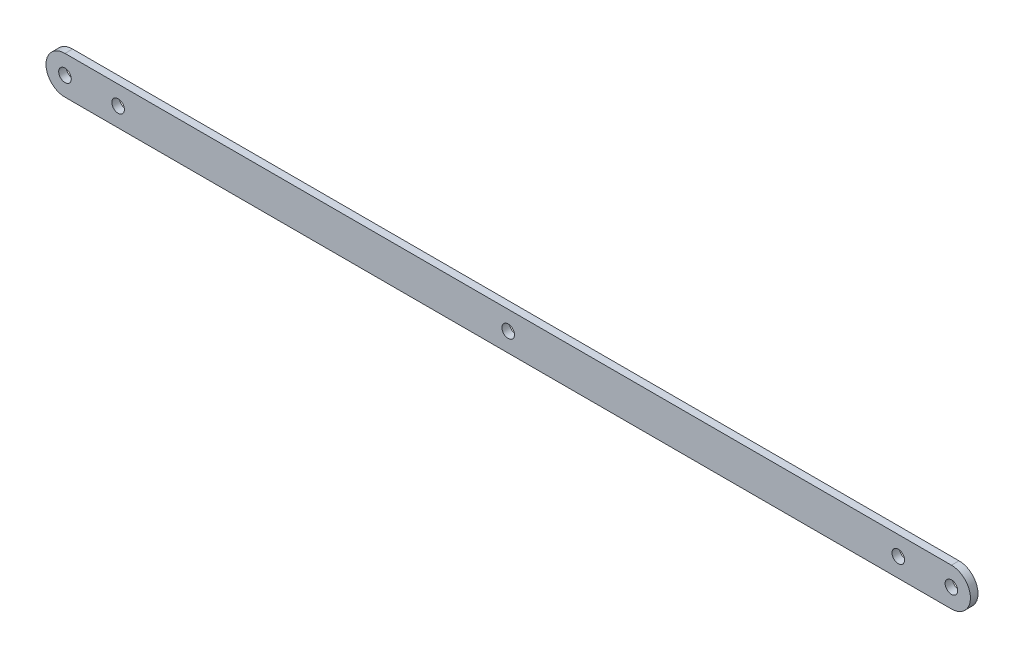
ISO-10303-21;
HEADER;
FILE_DESCRIPTION(('STEP AP214'),'2;1');
FILE_NAME('part.step','',(''),(''),'','','');
FILE_SCHEMA(('AUTOMOTIVE_DESIGN { 1 0 10303 214 1 1 1 1 }'));
ENDSEC;
DATA;
#1=APPLICATION_CONTEXT('core data for automotive mechanical design processes');
#2=APPLICATION_PROTOCOL_DEFINITION('international standard','automotive_design',2000,#1);
#3=PRODUCT_CONTEXT('',#1,'mechanical');
#4=PRODUCT('Part','Part','',(#3));
#5=PRODUCT_RELATED_PRODUCT_CATEGORY('part','',(#4));
#6=PRODUCT_DEFINITION_FORMATION('','',#4);
#7=PRODUCT_DEFINITION_CONTEXT('part definition',#1,'design');
#8=PRODUCT_DEFINITION('design','',#6,#7);
#9=PRODUCT_DEFINITION_SHAPE('','',#8);
#10=(LENGTH_UNIT() NAMED_UNIT(*) SI_UNIT(.MILLI.,.METRE.));
#11=(NAMED_UNIT(*) PLANE_ANGLE_UNIT() SI_UNIT($,.RADIAN.));
#12=(NAMED_UNIT(*) SI_UNIT($,.STERADIAN.) SOLID_ANGLE_UNIT());
#13=UNCERTAINTY_MEASURE_WITH_UNIT(LENGTH_MEASURE(1.E-05),#10,'distance_accuracy_value','');
#14=(GEOMETRIC_REPRESENTATION_CONTEXT(3) GLOBAL_UNCERTAINTY_ASSIGNED_CONTEXT((#13)) GLOBAL_UNIT_ASSIGNED_CONTEXT((#10,
#11,#12)) REPRESENTATION_CONTEXT('',''));
#15=CARTESIAN_POINT('',(0.,0.,0.));
#16=DIRECTION('',(0.,0.,1.));
#17=DIRECTION('',(1.,0.,0.));
#18=AXIS2_PLACEMENT_3D('',#15,#16,#17);
#19=CARTESIAN_POINT('',(0.,0.,5.));
#20=DIRECTION('',(0.,0.,1.));
#21=DIRECTION('',(1.,0.,0.));
#22=AXIS2_PLACEMENT_3D('',#19,#20,#21);
#23=PLANE('',#22);
#24=CARTESIAN_POINT('',(292.,0.,5.));
#25=DIRECTION('',(0.,0.,1.));
#26=DIRECTION('',(1.,0.,0.));
#27=AXIS2_PLACEMENT_3D('',#24,#25,#26);
#28=CIRCLE('',#27,4.15000000000001);
#29=CARTESIAN_POINT('',(296.15,0.,5.));
#30=VERTEX_POINT('',#29);
#31=EDGE_CURVE('E127',#30,#30,#28,.T.);
#32=ORIENTED_EDGE('',*,*,#31,.F.);
#33=EDGE_LOOP('',(#32));
#34=FACE_BOUND('',#33,.T.);
#35=CARTESIAN_POINT('',(584.,0.,5.));
#36=DIRECTION('',(0.,0.,1.));
#37=DIRECTION('',(1.,0.,0.));
#38=AXIS2_PLACEMENT_3D('',#35,#36,#37);
#39=CIRCLE('',#38,4.14999999999996);
#40=CARTESIAN_POINT('',(588.15,0.,5.));
#41=VERTEX_POINT('',#40);
#42=EDGE_CURVE('E115',#41,#41,#39,.T.);
#43=ORIENTED_EDGE('',*,*,#42,.F.);
#44=EDGE_LOOP('',(#43));
#45=FACE_BOUND('',#44,.T.);
#46=CARTESIAN_POINT('',(0.,0.,5.));
#47=DIRECTION('',(0.,0.,1.));
#48=DIRECTION('',(1.,0.,0.));
#49=AXIS2_PLACEMENT_3D('',#46,#47,#48);
#50=CIRCLE('',#49,12.5);
#51=CARTESIAN_POINT('',(0.,12.5,5.));
#52=VERTEX_POINT('',#51);
#53=CARTESIAN_POINT('',(0.,-12.5,5.));
#54=VERTEX_POINT('',#53);
#55=EDGE_CURVE('E85',#52,#54,#50,.T.);
#56=ORIENTED_EDGE('',*,*,#55,.T.);
#57=DIRECTION('',(1.,0.,0.));
#58=VECTOR('',#57,1.);
#59=CARTESIAN_POINT('',(0.,-12.5,5.));
#60=LINE('',#59,#58);
#61=CARTESIAN_POINT('',(584.,-12.5,5.));
#62=VERTEX_POINT('',#61);
#63=EDGE_CURVE('E80',#54,#62,#60,.T.);
#64=ORIENTED_EDGE('',*,*,#63,.T.);
#65=CARTESIAN_POINT('',(584.,0.,5.));
#66=DIRECTION('',(0.,0.,1.));
#67=DIRECTION('',(-1.,0.,0.));
#68=AXIS2_PLACEMENT_3D('',#65,#66,#67);
#69=CIRCLE('',#68,12.5);
#70=CARTESIAN_POINT('',(584.,12.5,5.));
#71=VERTEX_POINT('',#70);
#72=EDGE_CURVE('E83',#62,#71,#69,.T.);
#73=ORIENTED_EDGE('',*,*,#72,.T.);
#74=DIRECTION('',(-1.,0.,0.));
#75=VECTOR('',#74,1.);
#76=CARTESIAN_POINT('',(0.,12.5,5.));
#77=LINE('',#76,#75);
#78=EDGE_CURVE('E50',#71,#52,#77,.T.);
#79=ORIENTED_EDGE('',*,*,#78,.T.);
#80=EDGE_LOOP('',(#56,#64,#73,#79));
#81=FACE_BOUND('',#80,.T.);
#82=CARTESIAN_POINT('',(0.,0.,5.));
#83=DIRECTION('',(0.,0.,1.));
#84=DIRECTION('',(1.,0.,0.));
#85=AXIS2_PLACEMENT_3D('',#82,#83,#84);
#86=CIRCLE('',#85,4.15);
#87=CARTESIAN_POINT('',(4.15,0.,5.));
#88=VERTEX_POINT('',#87);
#89=EDGE_CURVE('E100',#88,#88,#86,.T.);
#90=ORIENTED_EDGE('',*,*,#89,.F.);
#91=EDGE_LOOP('',(#90));
#92=FACE_BOUND('',#91,.T.);
#93=CARTESIAN_POINT('',(35.,0.,5.));
#94=DIRECTION('',(0.,0.,1.));
#95=DIRECTION('',(1.,0.,0.));
#96=AXIS2_PLACEMENT_3D('',#93,#94,#95);
#97=CIRCLE('',#96,4.15);
#98=CARTESIAN_POINT('',(39.15,0.,5.));
#99=VERTEX_POINT('',#98);
#100=EDGE_CURVE('E121',#99,#99,#97,.T.);
#101=ORIENTED_EDGE('',*,*,#100,.F.);
#102=EDGE_LOOP('',(#101));
#103=FACE_BOUND('',#102,.T.);
#104=CARTESIAN_POINT('',(549.,0.,5.));
#105=DIRECTION('',(0.,0.,1.));
#106=DIRECTION('',(1.,0.,0.));
#107=AXIS2_PLACEMENT_3D('',#104,#105,#106);
#108=CIRCLE('',#107,4.14999999999996);
#109=CARTESIAN_POINT('',(553.15,0.,5.));
#110=VERTEX_POINT('',#109);
#111=EDGE_CURVE('E133',#110,#110,#108,.T.);
#112=ORIENTED_EDGE('',*,*,#111,.F.);
#113=EDGE_LOOP('',(#112));
#114=FACE_BOUND('',#113,.T.);
#115=ADVANCED_FACE('F33',(#34,#45,#81,#92,#103,#114),#23,.T.);
#116=CARTESIAN_POINT('',(0.,0.,0.));
#117=DIRECTION('',(0.,0.,1.));
#118=DIRECTION('',(1.,0.,0.));
#119=AXIS2_PLACEMENT_3D('',#116,#117,#118);
#120=PLANE('',#119);
#121=CARTESIAN_POINT('',(292.,0.,0.));
#122=DIRECTION('',(0.,0.,1.));
#123=DIRECTION('',(1.,0.,0.));
#124=AXIS2_PLACEMENT_3D('',#121,#122,#123);
#125=CIRCLE('',#124,4.15000000000001);
#126=CARTESIAN_POINT('',(296.15,0.,0.));
#127=VERTEX_POINT('',#126);
#128=EDGE_CURVE('E130',#127,#127,#125,.T.);
#129=ORIENTED_EDGE('',*,*,#128,.T.);
#130=EDGE_LOOP('',(#129));
#131=FACE_BOUND('',#130,.T.);
#132=CARTESIAN_POINT('',(584.,0.,0.));
#133=DIRECTION('',(0.,0.,1.));
#134=DIRECTION('',(1.,0.,0.));
#135=AXIS2_PLACEMENT_3D('',#132,#133,#134);
#136=CIRCLE('',#135,4.14999999999996);
#137=CARTESIAN_POINT('',(588.15,0.,0.));
#138=VERTEX_POINT('',#137);
#139=EDGE_CURVE('E118',#138,#138,#136,.T.);
#140=ORIENTED_EDGE('',*,*,#139,.T.);
#141=EDGE_LOOP('',(#140));
#142=FACE_BOUND('',#141,.T.);
#143=CARTESIAN_POINT('',(0.,0.,0.));
#144=DIRECTION('',(0.,0.,1.));
#145=DIRECTION('',(1.,0.,0.));
#146=AXIS2_PLACEMENT_3D('',#143,#144,#145);
#147=CIRCLE('',#146,12.5);
#148=CARTESIAN_POINT('',(0.,12.5,0.));
#149=VERTEX_POINT('',#148);
#150=CARTESIAN_POINT('',(0.,-12.5,0.));
#151=VERTEX_POINT('',#150);
#152=EDGE_CURVE('E97',#149,#151,#147,.T.);
#153=ORIENTED_EDGE('',*,*,#152,.F.);
#154=DIRECTION('',(-1.,0.,0.));
#155=VECTOR('',#154,1.);
#156=CARTESIAN_POINT('',(0.,12.5,0.));
#157=LINE('',#156,#155);
#158=CARTESIAN_POINT('',(584.,12.5,0.));
#159=VERTEX_POINT('',#158);
#160=EDGE_CURVE('E73',#159,#149,#157,.T.);
#161=ORIENTED_EDGE('',*,*,#160,.F.);
#162=CARTESIAN_POINT('',(584.,0.,0.));
#163=DIRECTION('',(0.,0.,1.));
#164=DIRECTION('',(-1.,0.,0.));
#165=AXIS2_PLACEMENT_3D('',#162,#163,#164);
#166=CIRCLE('',#165,12.5);
#167=CARTESIAN_POINT('',(584.,-12.5,0.));
#168=VERTEX_POINT('',#167);
#169=EDGE_CURVE('E67',#168,#159,#166,.T.);
#170=ORIENTED_EDGE('',*,*,#169,.F.);
#171=DIRECTION('',(1.,0.,0.));
#172=VECTOR('',#171,1.);
#173=CARTESIAN_POINT('',(0.,-12.5,0.));
#174=LINE('',#173,#172);
#175=EDGE_CURVE('E89',#151,#168,#174,.T.);
#176=ORIENTED_EDGE('',*,*,#175,.F.);
#177=EDGE_LOOP('',(#153,#161,#170,#176));
#178=FACE_BOUND('',#177,.T.);
#179=CARTESIAN_POINT('',(0.,0.,0.));
#180=DIRECTION('',(0.,0.,1.));
#181=DIRECTION('',(1.,0.,0.));
#182=AXIS2_PLACEMENT_3D('',#179,#180,#181);
#183=CIRCLE('',#182,4.15);
#184=CARTESIAN_POINT('',(4.15,0.,0.));
#185=VERTEX_POINT('',#184);
#186=EDGE_CURVE('E112',#185,#185,#183,.T.);
#187=ORIENTED_EDGE('',*,*,#186,.T.);
#188=EDGE_LOOP('',(#187));
#189=FACE_BOUND('',#188,.T.);
#190=CARTESIAN_POINT('',(35.,0.,0.));
#191=DIRECTION('',(0.,0.,1.));
#192=DIRECTION('',(1.,0.,0.));
#193=AXIS2_PLACEMENT_3D('',#190,#191,#192);
#194=CIRCLE('',#193,4.15);
#195=CARTESIAN_POINT('',(39.15,0.,0.));
#196=VERTEX_POINT('',#195);
#197=EDGE_CURVE('E124',#196,#196,#194,.T.);
#198=ORIENTED_EDGE('',*,*,#197,.T.);
#199=EDGE_LOOP('',(#198));
#200=FACE_BOUND('',#199,.T.);
#201=CARTESIAN_POINT('',(549.,0.,0.));
#202=DIRECTION('',(0.,0.,1.));
#203=DIRECTION('',(1.,0.,0.));
#204=AXIS2_PLACEMENT_3D('',#201,#202,#203);
#205=CIRCLE('',#204,4.14999999999996);
#206=CARTESIAN_POINT('',(553.15,0.,0.));
#207=VERTEX_POINT('',#206);
#208=EDGE_CURVE('E136',#207,#207,#205,.T.);
#209=ORIENTED_EDGE('',*,*,#208,.T.);
#210=EDGE_LOOP('',(#209));
#211=FACE_BOUND('',#210,.T.);
#212=ADVANCED_FACE('F108',(#131,#142,#178,#189,#200,#211),#120,.F.);
#213=CARTESIAN_POINT('',(0.,0.,5.));
#214=DIRECTION('',(0.,0.,-1.));
#215=DIRECTION('',(-1.,0.,0.));
#216=AXIS2_PLACEMENT_3D('',#213,#214,#215);
#217=CYLINDRICAL_SURFACE('',#216,12.5);
#218=ORIENTED_EDGE('',*,*,#152,.T.);
#219=DIRECTION('',(0.,0.,-1.));
#220=VECTOR('',#219,1.);
#221=CARTESIAN_POINT('',(0.,-12.5,5.));
#222=LINE('',#221,#220);
#223=EDGE_CURVE('E11',#54,#151,#222,.T.);
#224=ORIENTED_EDGE('',*,*,#223,.F.);
#225=ORIENTED_EDGE('',*,*,#55,.F.);
#226=DIRECTION('',(0.,0.,-1.));
#227=VECTOR('',#226,1.);
#228=CARTESIAN_POINT('',(0.,12.5,5.));
#229=LINE('',#228,#227);
#230=EDGE_CURVE('E93',#52,#149,#229,.T.);
#231=ORIENTED_EDGE('',*,*,#230,.T.);
#232=EDGE_LOOP('',(#218,#224,#225,#231));
#233=FACE_BOUND('',#232,.T.);
#234=ADVANCED_FACE('F35',(#233),#217,.T.);
#235=CARTESIAN_POINT('',(0.,-12.5,5.));
#236=DIRECTION('',(0.,1.,0.));
#237=DIRECTION('',(0.,0.,1.));
#238=AXIS2_PLACEMENT_3D('',#235,#236,#237);
#239=PLANE('',#238);
#240=ORIENTED_EDGE('',*,*,#175,.T.);
#241=DIRECTION('',(0.,0.,-1.));
#242=VECTOR('',#241,1.);
#243=CARTESIAN_POINT('',(584.,-12.5,5.));
#244=LINE('',#243,#242);
#245=EDGE_CURVE('E42',#62,#168,#244,.T.);
#246=ORIENTED_EDGE('',*,*,#245,.F.);
#247=ORIENTED_EDGE('',*,*,#63,.F.);
#248=ORIENTED_EDGE('',*,*,#223,.T.);
#249=EDGE_LOOP('',(#240,#246,#247,#248));
#250=FACE_BOUND('',#249,.T.);
#251=ADVANCED_FACE('F88',(#250),#239,.F.);
#252=CARTESIAN_POINT('',(584.,0.,5.));
#253=DIRECTION('',(0.,0.,-1.));
#254=DIRECTION('',(-1.,0.,0.));
#255=AXIS2_PLACEMENT_3D('',#252,#253,#254);
#256=CYLINDRICAL_SURFACE('',#255,12.5);
#257=ORIENTED_EDGE('',*,*,#169,.T.);
#258=DIRECTION('',(0.,0.,-1.));
#259=VECTOR('',#258,1.);
#260=CARTESIAN_POINT('',(584.,12.5,5.));
#261=LINE('',#260,#259);
#262=EDGE_CURVE('E90',#71,#159,#261,.T.);
#263=ORIENTED_EDGE('',*,*,#262,.F.);
#264=ORIENTED_EDGE('',*,*,#72,.F.);
#265=ORIENTED_EDGE('',*,*,#245,.T.);
#266=EDGE_LOOP('',(#257,#263,#264,#265));
#267=FACE_BOUND('',#266,.T.);
#268=ADVANCED_FACE('F91',(#267),#256,.T.);
#269=CARTESIAN_POINT('',(0.,12.5,5.));
#270=DIRECTION('',(0.,-1.,0.));
#271=DIRECTION('',(0.,0.,-1.));
#272=AXIS2_PLACEMENT_3D('',#269,#270,#271);
#273=PLANE('',#272);
#274=ORIENTED_EDGE('',*,*,#160,.T.);
#275=ORIENTED_EDGE('',*,*,#230,.F.);
#276=ORIENTED_EDGE('',*,*,#78,.F.);
#277=ORIENTED_EDGE('',*,*,#262,.T.);
#278=EDGE_LOOP('',(#274,#275,#276,#277));
#279=FACE_BOUND('',#278,.T.);
#280=ADVANCED_FACE('F105',(#279),#273,.F.);
#281=CARTESIAN_POINT('',(0.,0.,5.));
#282=DIRECTION('',(0.,0.,-1.));
#283=DIRECTION('',(-1.,0.,0.));
#284=AXIS2_PLACEMENT_3D('',#281,#282,#283);
#285=CYLINDRICAL_SURFACE('',#284,4.15);
#286=ORIENTED_EDGE('',*,*,#89,.T.);
#287=EDGE_LOOP('',(#286));
#288=FACE_BOUND('',#287,.T.);
#289=ORIENTED_EDGE('',*,*,#186,.F.);
#290=EDGE_LOOP('',(#289));
#291=FACE_BOUND('',#290,.T.);
#292=ADVANCED_FACE('F156',(#288,#291),#285,.F.);
#293=CARTESIAN_POINT('',(584.,0.,5.));
#294=DIRECTION('',(0.,0.,-1.));
#295=DIRECTION('',(-1.,0.,0.));
#296=AXIS2_PLACEMENT_3D('',#293,#294,#295);
#297=CYLINDRICAL_SURFACE('',#296,4.14999999999996);
#298=ORIENTED_EDGE('',*,*,#42,.T.);
#299=EDGE_LOOP('',(#298));
#300=FACE_BOUND('',#299,.T.);
#301=ORIENTED_EDGE('',*,*,#139,.F.);
#302=EDGE_LOOP('',(#301));
#303=FACE_BOUND('',#302,.T.);
#304=ADVANCED_FACE('F202',(#300,#303),#297,.F.);
#305=CARTESIAN_POINT('',(35.,0.,5.));
#306=DIRECTION('',(0.,0.,-1.));
#307=DIRECTION('',(-1.,0.,0.));
#308=AXIS2_PLACEMENT_3D('',#305,#306,#307);
#309=CYLINDRICAL_SURFACE('',#308,4.15);
#310=ORIENTED_EDGE('',*,*,#100,.T.);
#311=EDGE_LOOP('',(#310));
#312=FACE_BOUND('',#311,.T.);
#313=ORIENTED_EDGE('',*,*,#197,.F.);
#314=EDGE_LOOP('',(#313));
#315=FACE_BOUND('',#314,.T.);
#316=ADVANCED_FACE('F210',(#312,#315),#309,.F.);
#317=CARTESIAN_POINT('',(292.,0.,5.));
#318=DIRECTION('',(0.,0.,-1.));
#319=DIRECTION('',(-1.,0.,0.));
#320=AXIS2_PLACEMENT_3D('',#317,#318,#319);
#321=CYLINDRICAL_SURFACE('',#320,4.15000000000001);
#322=ORIENTED_EDGE('',*,*,#31,.T.);
#323=EDGE_LOOP('',(#322));
#324=FACE_BOUND('',#323,.T.);
#325=ORIENTED_EDGE('',*,*,#128,.F.);
#326=EDGE_LOOP('',(#325));
#327=FACE_BOUND('',#326,.T.);
#328=ADVANCED_FACE('F218',(#324,#327),#321,.F.);
#329=CARTESIAN_POINT('',(549.,0.,5.));
#330=DIRECTION('',(0.,0.,-1.));
#331=DIRECTION('',(-1.,0.,0.));
#332=AXIS2_PLACEMENT_3D('',#329,#330,#331);
#333=CYLINDRICAL_SURFACE('',#332,4.14999999999996);
#334=ORIENTED_EDGE('',*,*,#111,.T.);
#335=EDGE_LOOP('',(#334));
#336=FACE_BOUND('',#335,.T.);
#337=ORIENTED_EDGE('',*,*,#208,.F.);
#338=EDGE_LOOP('',(#337));
#339=FACE_BOUND('',#338,.T.);
#340=ADVANCED_FACE('F142',(#336,#339),#333,.F.);
#341=CLOSED_SHELL('',(#115,#212,#234,#251,#268,#280,#292,#304,#316,#328,#340));
#342=MANIFOLD_SOLID_BREP('B2',#341);
#343=ADVANCED_BREP_SHAPE_REPRESENTATION('',(#18,#342),#14);
#344=SHAPE_DEFINITION_REPRESENTATION(#9,#343);
ENDSEC;
END-ISO-10303-21;
